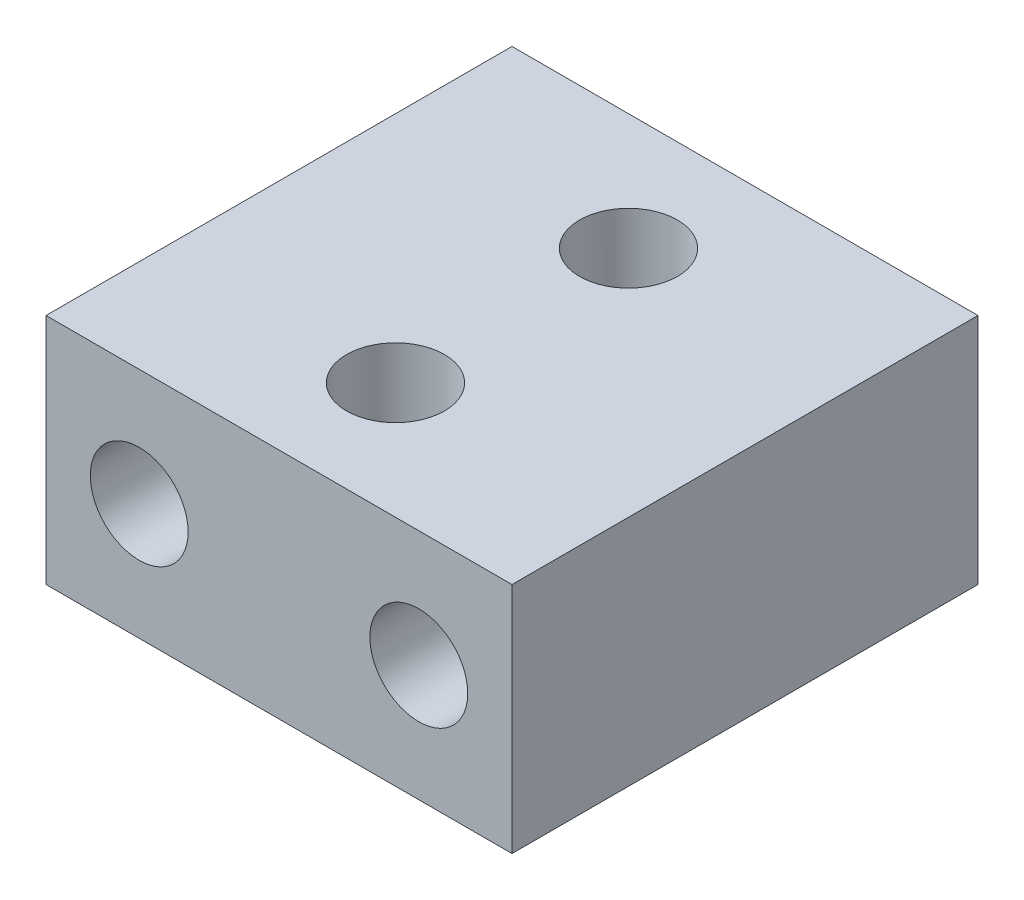
ISO-10303-21;
HEADER;
FILE_DESCRIPTION(('STEP AP214'),'2;1');
FILE_NAME('part.step','',(''),(''),'','','');
FILE_SCHEMA(('AUTOMOTIVE_DESIGN { 1 0 10303 214 1 1 1 1 }'));
ENDSEC;
DATA;
#1=APPLICATION_CONTEXT('core data for automotive mechanical design processes');
#2=APPLICATION_PROTOCOL_DEFINITION('international standard','automotive_design',2000,#1);
#3=PRODUCT_CONTEXT('',#1,'mechanical');
#4=PRODUCT('Part','Part','',(#3));
#5=PRODUCT_RELATED_PRODUCT_CATEGORY('part','',(#4));
#6=PRODUCT_DEFINITION_FORMATION('','',#4);
#7=PRODUCT_DEFINITION_CONTEXT('part definition',#1,'design');
#8=PRODUCT_DEFINITION('design','',#6,#7);
#9=PRODUCT_DEFINITION_SHAPE('','',#8);
#10=(LENGTH_UNIT() NAMED_UNIT(*) SI_UNIT(.MILLI.,.METRE.));
#11=(NAMED_UNIT(*) PLANE_ANGLE_UNIT() SI_UNIT($,.RADIAN.));
#12=(NAMED_UNIT(*) SI_UNIT($,.STERADIAN.) SOLID_ANGLE_UNIT());
#13=UNCERTAINTY_MEASURE_WITH_UNIT(LENGTH_MEASURE(1.E-05),#10,'distance_accuracy_value','');
#14=(GEOMETRIC_REPRESENTATION_CONTEXT(3) GLOBAL_UNCERTAINTY_ASSIGNED_CONTEXT((#13)) GLOBAL_UNIT_ASSIGNED_CONTEXT((#10,
#11,#12)) REPRESENTATION_CONTEXT('',''));
#15=CARTESIAN_POINT('',(0.,0.,0.));
#16=DIRECTION('',(0.,0.,1.));
#17=DIRECTION('',(1.,0.,0.));
#18=AXIS2_PLACEMENT_3D('',#15,#16,#17);
#19=CARTESIAN_POINT('',(0.,0.,20.));
#20=DIRECTION('',(0.,0.,-1.));
#21=DIRECTION('',(-1.,0.,0.));
#22=AXIS2_PLACEMENT_3D('',#19,#20,#21);
#23=PLANE('',#22);
#24=CARTESIAN_POINT('',(4.,5.,20.));
#25=DIRECTION('',(0.,0.,1.));
#26=DIRECTION('',(1.,0.,0.));
#27=AXIS2_PLACEMENT_3D('',#24,#25,#26);
#28=CIRCLE('',#27,2.1);
#29=CARTESIAN_POINT('',(6.1,5.,20.));
#30=VERTEX_POINT('',#29);
#31=EDGE_CURVE('E103',#30,#30,#28,.T.);
#32=ORIENTED_EDGE('',*,*,#31,.F.);
#33=EDGE_LOOP('',(#32));
#34=FACE_BOUND('',#33,.T.);
#35=DIRECTION('',(0.,-1.,0.));
#36=VECTOR('',#35,1.);
#37=CARTESIAN_POINT('',(0.,0.,20.));
#38=LINE('',#37,#36);
#39=CARTESIAN_POINT('',(0.,10.,20.));
#40=VERTEX_POINT('',#39);
#41=CARTESIAN_POINT('',(0.,0.,20.));
#42=VERTEX_POINT('',#41);
#43=EDGE_CURVE('E87',#40,#42,#38,.T.);
#44=ORIENTED_EDGE('',*,*,#43,.T.);
#45=DIRECTION('',(1.,0.,0.));
#46=VECTOR('',#45,1.);
#47=CARTESIAN_POINT('',(0.,0.,20.));
#48=LINE('',#47,#46);
#49=CARTESIAN_POINT('',(20.,0.,20.));
#50=VERTEX_POINT('',#49);
#51=EDGE_CURVE('E82',#42,#50,#48,.T.);
#52=ORIENTED_EDGE('',*,*,#51,.T.);
#53=DIRECTION('',(0.,1.,0.));
#54=VECTOR('',#53,1.);
#55=CARTESIAN_POINT('',(20.,0.,20.));
#56=LINE('',#55,#54);
#57=CARTESIAN_POINT('',(20.,10.,20.));
#58=VERTEX_POINT('',#57);
#59=EDGE_CURVE('E85',#50,#58,#56,.T.);
#60=ORIENTED_EDGE('',*,*,#59,.T.);
#61=DIRECTION('',(-1.,0.,0.));
#62=VECTOR('',#61,1.);
#63=CARTESIAN_POINT('',(0.,10.,20.));
#64=LINE('',#63,#62);
#65=EDGE_CURVE('E52',#58,#40,#64,.T.);
#66=ORIENTED_EDGE('',*,*,#65,.T.);
#67=EDGE_LOOP('',(#44,#52,#60,#66));
#68=FACE_BOUND('',#67,.T.);
#69=CARTESIAN_POINT('',(16.,5.,20.));
#70=DIRECTION('',(0.,0.,1.));
#71=DIRECTION('',(1.,0.,0.));
#72=AXIS2_PLACEMENT_3D('',#69,#70,#71);
#73=CIRCLE('',#72,2.1);
#74=CARTESIAN_POINT('',(18.1,5.,20.));
#75=VERTEX_POINT('',#74);
#76=EDGE_CURVE('E115',#75,#75,#73,.T.);
#77=ORIENTED_EDGE('',*,*,#76,.F.);
#78=EDGE_LOOP('',(#77));
#79=FACE_BOUND('',#78,.T.);
#80=ADVANCED_FACE('F33',(#34,#68,#79),#23,.F.);
#81=CARTESIAN_POINT('',(0.,0.,0.));
#82=DIRECTION('',(0.,0.,-1.));
#83=DIRECTION('',(-1.,0.,0.));
#84=AXIS2_PLACEMENT_3D('',#81,#82,#83);
#85=PLANE('',#84);
#86=CARTESIAN_POINT('',(4.,5.,0.));
#87=DIRECTION('',(0.,0.,1.));
#88=DIRECTION('',(1.,0.,0.));
#89=AXIS2_PLACEMENT_3D('',#86,#87,#88);
#90=CIRCLE('',#89,2.1);
#91=CARTESIAN_POINT('',(6.1,5.,0.));
#92=VERTEX_POINT('',#91);
#93=EDGE_CURVE('E126',#92,#92,#90,.T.);
#94=ORIENTED_EDGE('',*,*,#93,.T.);
#95=EDGE_LOOP('',(#94));
#96=FACE_BOUND('',#95,.T.);
#97=DIRECTION('',(0.,-1.,0.));
#98=VECTOR('',#97,1.);
#99=CARTESIAN_POINT('',(0.,0.,0.));
#100=LINE('',#99,#98);
#101=CARTESIAN_POINT('',(0.,10.,0.));
#102=VERTEX_POINT('',#101);
#103=CARTESIAN_POINT('',(0.,0.,0.));
#104=VERTEX_POINT('',#103);
#105=EDGE_CURVE('E100',#102,#104,#100,.T.);
#106=ORIENTED_EDGE('',*,*,#105,.F.);
#107=DIRECTION('',(-1.,0.,0.));
#108=VECTOR('',#107,1.);
#109=CARTESIAN_POINT('',(0.,10.,0.));
#110=LINE('',#109,#108);
#111=CARTESIAN_POINT('',(20.,10.,0.));
#112=VERTEX_POINT('',#111);
#113=EDGE_CURVE('E75',#112,#102,#110,.T.);
#114=ORIENTED_EDGE('',*,*,#113,.F.);
#115=DIRECTION('',(0.,1.,0.));
#116=VECTOR('',#115,1.);
#117=CARTESIAN_POINT('',(20.,0.,0.));
#118=LINE('',#117,#116);
#119=CARTESIAN_POINT('',(20.,0.,0.));
#120=VERTEX_POINT('',#119);
#121=EDGE_CURVE('E69',#120,#112,#118,.T.);
#122=ORIENTED_EDGE('',*,*,#121,.F.);
#123=DIRECTION('',(1.,0.,0.));
#124=VECTOR('',#123,1.);
#125=CARTESIAN_POINT('',(0.,0.,0.));
#126=LINE('',#125,#124);
#127=EDGE_CURVE('E91',#104,#120,#126,.T.);
#128=ORIENTED_EDGE('',*,*,#127,.F.);
#129=EDGE_LOOP('',(#106,#114,#122,#128));
#130=FACE_BOUND('',#129,.T.);
#131=CARTESIAN_POINT('',(16.,5.,0.));
#132=DIRECTION('',(0.,0.,1.));
#133=DIRECTION('',(1.,0.,0.));
#134=AXIS2_PLACEMENT_3D('',#131,#132,#133);
#135=CIRCLE('',#134,2.1);
#136=CARTESIAN_POINT('',(18.1,5.,0.));
#137=VERTEX_POINT('',#136);
#138=EDGE_CURVE('E110',#137,#137,#135,.T.);
#139=ORIENTED_EDGE('',*,*,#138,.T.);
#140=EDGE_LOOP('',(#139));
#141=FACE_BOUND('',#140,.T.);
#142=ADVANCED_FACE('F133',(#96,#130,#141),#85,.T.);
#143=CARTESIAN_POINT('',(0.,0.,20.));
#144=DIRECTION('',(1.,0.,0.));
#145=DIRECTION('',(0.,0.,-1.));
#146=AXIS2_PLACEMENT_3D('',#143,#144,#145);
#147=PLANE('',#146);
#148=ORIENTED_EDGE('',*,*,#105,.T.);
#149=DIRECTION('',(0.,0.,-1.));
#150=VECTOR('',#149,1.);
#151=CARTESIAN_POINT('',(0.,0.,20.));
#152=LINE('',#151,#150);
#153=EDGE_CURVE('E11',#42,#104,#152,.T.);
#154=ORIENTED_EDGE('',*,*,#153,.F.);
#155=ORIENTED_EDGE('',*,*,#43,.F.);
#156=DIRECTION('',(0.,0.,-1.));
#157=VECTOR('',#156,1.);
#158=CARTESIAN_POINT('',(0.,10.,20.));
#159=LINE('',#158,#157);
#160=EDGE_CURVE('E96',#40,#102,#159,.T.);
#161=ORIENTED_EDGE('',*,*,#160,.T.);
#162=EDGE_LOOP('',(#148,#154,#155,#161));
#163=FACE_BOUND('',#162,.T.);
#164=ADVANCED_FACE('F35',(#163),#147,.F.);
#165=CARTESIAN_POINT('',(0.,0.,20.));
#166=DIRECTION('',(0.,1.,0.));
#167=DIRECTION('',(0.,0.,1.));
#168=AXIS2_PLACEMENT_3D('',#165,#166,#167);
#169=PLANE('',#168);
#170=CARTESIAN_POINT('',(10.,0.,5.));
#171=DIRECTION('',(0.,-1.,0.));
#172=DIRECTION('',(0.,0.,-1.));
#173=AXIS2_PLACEMENT_3D('',#170,#171,#172);
#174=CIRCLE('',#173,2.1);
#175=CARTESIAN_POINT('',(10.,0.,2.9));
#176=VERTEX_POINT('',#175);
#177=EDGE_CURVE('E122',#176,#176,#174,.T.);
#178=ORIENTED_EDGE('',*,*,#177,.F.);
#179=EDGE_LOOP('',(#178));
#180=FACE_BOUND('',#179,.T.);
#181=CARTESIAN_POINT('',(10.,0.,15.));
#182=DIRECTION('',(0.,-1.,0.));
#183=DIRECTION('',(0.,0.,-1.));
#184=AXIS2_PLACEMENT_3D('',#181,#182,#183);
#185=CIRCLE('',#184,2.1);
#186=CARTESIAN_POINT('',(10.,0.,12.9));
#187=VERTEX_POINT('',#186);
#188=EDGE_CURVE('E111',#187,#187,#185,.T.);
#189=ORIENTED_EDGE('',*,*,#188,.F.);
#190=EDGE_LOOP('',(#189));
#191=FACE_BOUND('',#190,.T.);
#192=ORIENTED_EDGE('',*,*,#127,.T.);
#193=DIRECTION('',(0.,0.,-1.));
#194=VECTOR('',#193,1.);
#195=CARTESIAN_POINT('',(20.,0.,20.));
#196=LINE('',#195,#194);
#197=EDGE_CURVE('E43',#50,#120,#196,.T.);
#198=ORIENTED_EDGE('',*,*,#197,.F.);
#199=ORIENTED_EDGE('',*,*,#51,.F.);
#200=ORIENTED_EDGE('',*,*,#153,.T.);
#201=EDGE_LOOP('',(#192,#198,#199,#200));
#202=FACE_BOUND('',#201,.T.);
#203=ADVANCED_FACE('F90',(#180,#191,#202),#169,.F.);
#204=CARTESIAN_POINT('',(20.,0.,20.));
#205=DIRECTION('',(-1.,0.,0.));
#206=DIRECTION('',(0.,0.,1.));
#207=AXIS2_PLACEMENT_3D('',#204,#205,#206);
#208=PLANE('',#207);
#209=ORIENTED_EDGE('',*,*,#121,.T.);
#210=DIRECTION('',(0.,0.,-1.));
#211=VECTOR('',#210,1.);
#212=CARTESIAN_POINT('',(20.,10.,20.));
#213=LINE('',#212,#211);
#214=EDGE_CURVE('E92',#58,#112,#213,.T.);
#215=ORIENTED_EDGE('',*,*,#214,.F.);
#216=ORIENTED_EDGE('',*,*,#59,.F.);
#217=ORIENTED_EDGE('',*,*,#197,.T.);
#218=EDGE_LOOP('',(#209,#215,#216,#217));
#219=FACE_BOUND('',#218,.T.);
#220=ADVANCED_FACE('F94',(#219),#208,.F.);
#221=CARTESIAN_POINT('',(0.,10.,20.));
#222=DIRECTION('',(0.,-1.,0.));
#223=DIRECTION('',(1.,0.,0.));
#224=AXIS2_PLACEMENT_3D('',#221,#222,#223);
#225=PLANE('',#224);
#226=CARTESIAN_POINT('',(10.,10.,5.));
#227=DIRECTION('',(0.,-1.,0.));
#228=DIRECTION('',(1.,0.,0.));
#229=AXIS2_PLACEMENT_3D('',#226,#227,#228);
#230=CIRCLE('',#229,2.1);
#231=CARTESIAN_POINT('',(12.1,10.,5.));
#232=VERTEX_POINT('',#231);
#233=EDGE_CURVE('E37',#232,#232,#230,.T.);
#234=ORIENTED_EDGE('',*,*,#233,.T.);
#235=EDGE_LOOP('',(#234));
#236=FACE_BOUND('',#235,.T.);
#237=CARTESIAN_POINT('',(10.,10.,15.));
#238=DIRECTION('',(0.,-1.,0.));
#239=DIRECTION('',(1.,0.,0.));
#240=AXIS2_PLACEMENT_3D('',#237,#238,#239);
#241=CIRCLE('',#240,2.1);
#242=CARTESIAN_POINT('',(12.1,10.,15.));
#243=VERTEX_POINT('',#242);
#244=EDGE_CURVE('E108',#243,#243,#241,.T.);
#245=ORIENTED_EDGE('',*,*,#244,.T.);
#246=EDGE_LOOP('',(#245));
#247=FACE_BOUND('',#246,.T.);
#248=ORIENTED_EDGE('',*,*,#113,.T.);
#249=ORIENTED_EDGE('',*,*,#160,.F.);
#250=ORIENTED_EDGE('',*,*,#65,.F.);
#251=ORIENTED_EDGE('',*,*,#214,.T.);
#252=EDGE_LOOP('',(#248,#249,#250,#251));
#253=FACE_BOUND('',#252,.T.);
#254=ADVANCED_FACE('F139',(#236,#247,#253),#225,.F.);
#255=CARTESIAN_POINT('',(4.,5.,20.));
#256=DIRECTION('',(0.,0.,-1.));
#257=DIRECTION('',(-1.,0.,0.));
#258=AXIS2_PLACEMENT_3D('',#255,#256,#257);
#259=CYLINDRICAL_SURFACE('',#258,2.1);
#260=ORIENTED_EDGE('',*,*,#31,.T.);
#261=EDGE_LOOP('',(#260));
#262=FACE_BOUND('',#261,.T.);
#263=ORIENTED_EDGE('',*,*,#93,.F.);
#264=EDGE_LOOP('',(#263));
#265=FACE_BOUND('',#264,.T.);
#266=ADVANCED_FACE('F136',(#262,#265),#259,.F.);
#267=CARTESIAN_POINT('',(16.,5.,20.));
#268=DIRECTION('',(0.,0.,-1.));
#269=DIRECTION('',(-1.,0.,0.));
#270=AXIS2_PLACEMENT_3D('',#267,#268,#269);
#271=CYLINDRICAL_SURFACE('',#270,2.1);
#272=ORIENTED_EDGE('',*,*,#76,.T.);
#273=EDGE_LOOP('',(#272));
#274=FACE_BOUND('',#273,.T.);
#275=ORIENTED_EDGE('',*,*,#138,.F.);
#276=EDGE_LOOP('',(#275));
#277=FACE_BOUND('',#276,.T.);
#278=ADVANCED_FACE('F138',(#274,#277),#271,.F.);
#279=CARTESIAN_POINT('',(10.,30.,15.));
#280=DIRECTION('',(0.,-1.,0.));
#281=DIRECTION('',(0.,0.,-1.));
#282=AXIS2_PLACEMENT_3D('',#279,#280,#281);
#283=CYLINDRICAL_SURFACE('',#282,2.1);
#284=ORIENTED_EDGE('',*,*,#188,.T.);
#285=EDGE_LOOP('',(#284));
#286=FACE_BOUND('',#285,.T.);
#287=ORIENTED_EDGE('',*,*,#244,.F.);
#288=EDGE_LOOP('',(#287));
#289=FACE_BOUND('',#288,.T.);
#290=ADVANCED_FACE('F146',(#286,#289),#283,.F.);
#291=CARTESIAN_POINT('',(10.,30.,5.));
#292=DIRECTION('',(0.,-1.,0.));
#293=DIRECTION('',(0.,0.,-1.));
#294=AXIS2_PLACEMENT_3D('',#291,#292,#293);
#295=CYLINDRICAL_SURFACE('',#294,2.1);
#296=ORIENTED_EDGE('',*,*,#177,.T.);
#297=EDGE_LOOP('',(#296));
#298=FACE_BOUND('',#297,.T.);
#299=ORIENTED_EDGE('',*,*,#233,.F.);
#300=EDGE_LOOP('',(#299));
#301=FACE_BOUND('',#300,.T.);
#302=ADVANCED_FACE('F171',(#298,#301),#295,.F.);
#303=CLOSED_SHELL('',(#80,#142,#164,#203,#220,#254,#266,#278,#290,#302));
#304=MANIFOLD_SOLID_BREP('B2',#303);
#305=ADVANCED_BREP_SHAPE_REPRESENTATION('',(#18,#304),#14);
#306=SHAPE_DEFINITION_REPRESENTATION(#9,#305);
ENDSEC;
END-ISO-10303-21;
